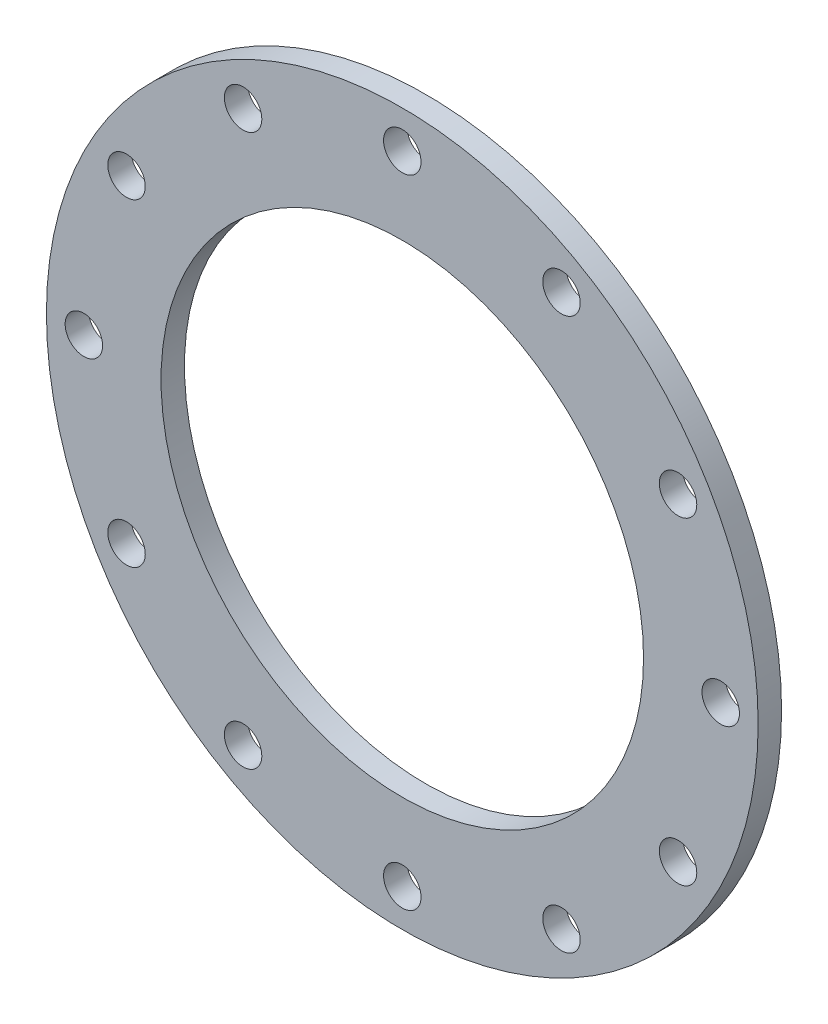
ISO-10303-21;
HEADER;
FILE_DESCRIPTION(('STEP AP214'),'2;1');
FILE_NAME('part.step','',(''),(''),'','','');
FILE_SCHEMA(('AUTOMOTIVE_DESIGN { 1 0 10303 214 1 1 1 1 }'));
ENDSEC;
DATA;
#1=APPLICATION_CONTEXT('core data for automotive mechanical design processes');
#2=APPLICATION_PROTOCOL_DEFINITION('international standard','automotive_design',2000,#1);
#3=PRODUCT_CONTEXT('',#1,'mechanical');
#4=PRODUCT('Part','Part','',(#3));
#5=PRODUCT_RELATED_PRODUCT_CATEGORY('part','',(#4));
#6=PRODUCT_DEFINITION_FORMATION('','',#4);
#7=PRODUCT_DEFINITION_CONTEXT('part definition',#1,'design');
#8=PRODUCT_DEFINITION('design','',#6,#7);
#9=PRODUCT_DEFINITION_SHAPE('','',#8);
#10=(LENGTH_UNIT() NAMED_UNIT(*) SI_UNIT(.MILLI.,.METRE.));
#11=(NAMED_UNIT(*) PLANE_ANGLE_UNIT() SI_UNIT($,.RADIAN.));
#12=(NAMED_UNIT(*) SI_UNIT($,.STERADIAN.) SOLID_ANGLE_UNIT());
#13=UNCERTAINTY_MEASURE_WITH_UNIT(LENGTH_MEASURE(1.E-05),#10,'distance_accuracy_value','');
#14=(GEOMETRIC_REPRESENTATION_CONTEXT(3) GLOBAL_UNCERTAINTY_ASSIGNED_CONTEXT((#13)) GLOBAL_UNIT_ASSIGNED_CONTEXT((#10,
#11,#12)) REPRESENTATION_CONTEXT('',''));
#15=CARTESIAN_POINT('',(0.,0.,0.));
#16=DIRECTION('',(0.,0.,1.));
#17=DIRECTION('',(1.,0.,0.));
#18=AXIS2_PLACEMENT_3D('',#15,#16,#17);
#19=CARTESIAN_POINT('',(0.,0.,7.9375));
#20=DIRECTION('',(0.,0.,1.));
#21=DIRECTION('',(1.,0.,0.));
#22=AXIS2_PLACEMENT_3D('',#19,#20,#21);
#23=PLANE('',#22);
#24=CARTESIAN_POINT('',(107.95,-186.974884677061,7.9375));
#25=DIRECTION('',(0.,0.,1.));
#26=DIRECTION('',(0.499999999999998,-0.86602540378444,0.));
#27=AXIS2_PLACEMENT_3D('',#24,#25,#26);
#28=CIRCLE('',#27,12.7);
#29=CARTESIAN_POINT('',(114.3,-197.973407305123,7.9375));
#30=VERTEX_POINT('',#29);
#31=EDGE_CURVE('E84',#30,#30,#28,.T.);
#32=ORIENTED_EDGE('',*,*,#31,.F.);
#33=EDGE_LOOP('',(#32));
#34=FACE_BOUND('',#33,.T.);
#35=CARTESIAN_POINT('',(-7.39933033248418E-13,-215.9,7.9375));
#36=DIRECTION('',(0.,0.,1.));
#37=DIRECTION('',(0.,-1.,0.));
#38=AXIS2_PLACEMENT_3D('',#35,#36,#37);
#39=CIRCLE('',#38,12.7);
#40=CARTESIAN_POINT('',(-7.84274846251726E-13,-228.6,7.9375));
#41=VERTEX_POINT('',#40);
#42=EDGE_CURVE('E135',#41,#41,#39,.T.);
#43=ORIENTED_EDGE('',*,*,#42,.F.);
#44=EDGE_LOOP('',(#43));
#45=FACE_BOUND('',#44,.T.);
#46=CARTESIAN_POINT('',(-107.950000000001,-186.97488467706,7.9375));
#47=DIRECTION('',(0.,0.,1.));
#48=DIRECTION('',(-0.500000000000004,-0.866025403784436,0.));
#49=AXIS2_PLACEMENT_3D('',#46,#47,#48);
#50=CIRCLE('',#49,12.7);
#51=CARTESIAN_POINT('',(-114.300000000001,-197.973407305122,7.9375));
#52=VERTEX_POINT('',#51);
#53=EDGE_CURVE('E127',#52,#52,#50,.T.);
#54=ORIENTED_EDGE('',*,*,#53,.F.);
#55=EDGE_LOOP('',(#54));
#56=FACE_BOUND('',#55,.T.);
#57=CARTESIAN_POINT('',(-186.974884677061,-107.949999999999,7.9375));
#58=DIRECTION('',(0.,0.,1.));
#59=DIRECTION('',(-0.866025403784442,-0.499999999999995,0.));
#60=AXIS2_PLACEMENT_3D('',#57,#58,#59);
#61=CIRCLE('',#60,12.7);
#62=CARTESIAN_POINT('',(-197.973407305123,-114.299999999999,7.9375));
#63=VERTEX_POINT('',#62);
#64=EDGE_CURVE('E119',#63,#63,#61,.T.);
#65=ORIENTED_EDGE('',*,*,#64,.F.);
#66=EDGE_LOOP('',(#65));
#67=FACE_BOUND('',#66,.T.);
#68=CARTESIAN_POINT('',(-215.9,0.,7.9375));
#69=DIRECTION('',(0.,0.,1.));
#70=DIRECTION('',(-1.,0.,0.));
#71=AXIS2_PLACEMENT_3D('',#68,#69,#70);
#72=CIRCLE('',#71,12.7);
#73=CARTESIAN_POINT('',(-228.6,0.,7.9375));
#74=VERTEX_POINT('',#73);
#75=EDGE_CURVE('E111',#74,#74,#72,.T.);
#76=ORIENTED_EDGE('',*,*,#75,.F.);
#77=EDGE_LOOP('',(#76));
#78=FACE_BOUND('',#77,.T.);
#79=CARTESIAN_POINT('',(-186.974884677059,107.950000000002,7.9375));
#80=DIRECTION('',(0.,0.,1.));
#81=DIRECTION('',(-0.866025403784435,0.500000000000007,0.));
#82=AXIS2_PLACEMENT_3D('',#79,#80,#81);
#83=CIRCLE('',#82,12.7);
#84=CARTESIAN_POINT('',(-197.973407305122,114.300000000002,7.9375));
#85=VERTEX_POINT('',#84);
#86=EDGE_CURVE('E103',#85,#85,#83,.T.);
#87=ORIENTED_EDGE('',*,*,#86,.F.);
#88=EDGE_LOOP('',(#87));
#89=FACE_BOUND('',#88,.T.);
#90=CARTESIAN_POINT('',(-107.949999999998,186.974884677061,7.9375));
#91=DIRECTION('',(0.,0.,1.));
#92=DIRECTION('',(-0.499999999999992,0.866025403784443,0.));
#93=AXIS2_PLACEMENT_3D('',#90,#91,#92);
#94=CIRCLE('',#93,12.7);
#95=CARTESIAN_POINT('',(-114.299999999998,197.973407305124,7.9375));
#96=VERTEX_POINT('',#95);
#97=EDGE_CURVE('E95',#96,#96,#94,.T.);
#98=ORIENTED_EDGE('',*,*,#97,.F.);
#99=EDGE_LOOP('',(#98));
#100=FACE_BOUND('',#99,.T.);
#101=CARTESIAN_POINT('',(2.24755467536088E-12,215.9,7.9375));
#102=DIRECTION('',(0.,0.,1.));
#103=DIRECTION('',(0.,1.,0.));
#104=AXIS2_PLACEMENT_3D('',#101,#102,#103);
#105=CIRCLE('',#104,12.7);
#106=CARTESIAN_POINT('',(2.38058011437081E-12,228.6,7.9375));
#107=VERTEX_POINT('',#106);
#108=EDGE_CURVE('E85',#107,#107,#105,.T.);
#109=ORIENTED_EDGE('',*,*,#108,.F.);
#110=EDGE_LOOP('',(#109));
#111=FACE_BOUND('',#110,.T.);
#112=CARTESIAN_POINT('',(107.950000000002,186.974884677059,7.9375));
#113=DIRECTION('',(0.,0.,1.));
#114=DIRECTION('',(0.50000000000001,0.866025403784433,0.));
#115=AXIS2_PLACEMENT_3D('',#112,#113,#114);
#116=CIRCLE('',#115,12.7);
#117=CARTESIAN_POINT('',(114.300000000002,197.973407305121,7.9375));
#118=VERTEX_POINT('',#117);
#119=EDGE_CURVE('E94',#118,#118,#116,.T.);
#120=ORIENTED_EDGE('',*,*,#119,.F.);
#121=EDGE_LOOP('',(#120));
#122=FACE_BOUND('',#121,.T.);
#123=CARTESIAN_POINT('',(186.974884677062,107.949999999998,7.9375));
#124=DIRECTION('',(0.,0.,1.));
#125=DIRECTION('',(0.866025403784445,0.499999999999989,0.));
#126=AXIS2_PLACEMENT_3D('',#123,#124,#125);
#127=CIRCLE('',#126,12.7);
#128=CARTESIAN_POINT('',(197.973407305124,114.299999999997,7.9375));
#129=VERTEX_POINT('',#128);
#130=EDGE_CURVE('E149',#129,#129,#127,.T.);
#131=ORIENTED_EDGE('',*,*,#130,.F.);
#132=EDGE_LOOP('',(#131));
#133=FACE_BOUND('',#132,.T.);
#134=CARTESIAN_POINT('',(186.97488467706,-107.95,7.9375));
#135=DIRECTION('',(0.,0.,1.));
#136=DIRECTION('',(0.866025403784438,-0.500000000000001,0.));
#137=AXIS2_PLACEMENT_3D('',#134,#135,#136);
#138=CIRCLE('',#137,12.7);
#139=CARTESIAN_POINT('',(197.973407305122,-114.3,7.9375));
#140=VERTEX_POINT('',#139);
#141=EDGE_CURVE('E76',#140,#140,#138,.T.);
#142=ORIENTED_EDGE('',*,*,#141,.F.);
#143=EDGE_LOOP('',(#142));
#144=FACE_BOUND('',#143,.T.);
#145=CARTESIAN_POINT('',(215.9,0.,7.9375));
#146=DIRECTION('',(0.,0.,1.));
#147=DIRECTION('',(1.,0.,0.));
#148=AXIS2_PLACEMENT_3D('',#145,#146,#147);
#149=CIRCLE('',#148,12.7);
#150=CARTESIAN_POINT('',(228.6,0.,7.9375));
#151=VERTEX_POINT('',#150);
#152=EDGE_CURVE('E72',#151,#151,#149,.T.);
#153=ORIENTED_EDGE('',*,*,#152,.F.);
#154=EDGE_LOOP('',(#153));
#155=FACE_BOUND('',#154,.T.);
#156=CARTESIAN_POINT('',(0.,0.,7.9375));
#157=DIRECTION('',(0.,0.,1.));
#158=DIRECTION('',(1.,0.,0.));
#159=AXIS2_PLACEMENT_3D('',#156,#157,#158);
#160=CIRCLE('',#159,241.3);
#161=CARTESIAN_POINT('',(241.3,0.,7.9375));
#162=VERTEX_POINT('',#161);
#163=EDGE_CURVE('E11',#162,#162,#160,.T.);
#164=ORIENTED_EDGE('',*,*,#163,.T.);
#165=EDGE_LOOP('',(#164));
#166=FACE_BOUND('',#165,.T.);
#167=CARTESIAN_POINT('',(0.,0.,7.9375));
#168=DIRECTION('',(0.,0.,1.));
#169=DIRECTION('',(1.,0.,0.));
#170=AXIS2_PLACEMENT_3D('',#167,#168,#169);
#171=CIRCLE('',#170,163.576);
#172=CARTESIAN_POINT('',(163.576,0.,7.9375));
#173=VERTEX_POINT('',#172);
#174=EDGE_CURVE('E59',#173,#173,#171,.T.);
#175=ORIENTED_EDGE('',*,*,#174,.F.);
#176=EDGE_LOOP('',(#175));
#177=FACE_BOUND('',#176,.T.);
#178=ADVANCED_FACE('F46',(#34,#45,#56,#67,#78,#89,#100,#111,#122,#133,#144,#155,#166,#177),#23,.T.);
#179=CARTESIAN_POINT('',(0.,0.,-7.9375));
#180=DIRECTION('',(0.,0.,1.));
#181=DIRECTION('',(1.,0.,0.));
#182=AXIS2_PLACEMENT_3D('',#179,#180,#181);
#183=PLANE('',#182);
#184=CARTESIAN_POINT('',(107.95,-186.974884677061,-7.9375));
#185=DIRECTION('',(0.,0.,1.));
#186=DIRECTION('',(0.499999999999998,-0.86602540378444,0.));
#187=AXIS2_PLACEMENT_3D('',#184,#185,#186);
#188=CIRCLE('',#187,12.7);
#189=CARTESIAN_POINT('',(114.3,-197.973407305123,-7.9375));
#190=VERTEX_POINT('',#189);
#191=EDGE_CURVE('E139',#190,#190,#188,.T.);
#192=ORIENTED_EDGE('',*,*,#191,.T.);
#193=EDGE_LOOP('',(#192));
#194=FACE_BOUND('',#193,.T.);
#195=CARTESIAN_POINT('',(-7.39933033248418E-13,-215.9,-7.9375));
#196=DIRECTION('',(0.,0.,1.));
#197=DIRECTION('',(0.,-1.,0.));
#198=AXIS2_PLACEMENT_3D('',#195,#196,#197);
#199=CIRCLE('',#198,12.7);
#200=CARTESIAN_POINT('',(-7.84274846251726E-13,-228.6,-7.9375));
#201=VERTEX_POINT('',#200);
#202=EDGE_CURVE('E131',#201,#201,#199,.T.);
#203=ORIENTED_EDGE('',*,*,#202,.T.);
#204=EDGE_LOOP('',(#203));
#205=FACE_BOUND('',#204,.T.);
#206=CARTESIAN_POINT('',(-107.950000000001,-186.97488467706,-7.9375));
#207=DIRECTION('',(0.,0.,1.));
#208=DIRECTION('',(-0.500000000000004,-0.866025403784436,0.));
#209=AXIS2_PLACEMENT_3D('',#206,#207,#208);
#210=CIRCLE('',#209,12.7);
#211=CARTESIAN_POINT('',(-114.300000000001,-197.973407305122,-7.9375));
#212=VERTEX_POINT('',#211);
#213=EDGE_CURVE('E123',#212,#212,#210,.T.);
#214=ORIENTED_EDGE('',*,*,#213,.T.);
#215=EDGE_LOOP('',(#214));
#216=FACE_BOUND('',#215,.T.);
#217=CARTESIAN_POINT('',(-186.974884677061,-107.949999999999,-7.9375));
#218=DIRECTION('',(0.,0.,1.));
#219=DIRECTION('',(-0.866025403784442,-0.499999999999995,0.));
#220=AXIS2_PLACEMENT_3D('',#217,#218,#219);
#221=CIRCLE('',#220,12.7);
#222=CARTESIAN_POINT('',(-197.973407305123,-114.299999999999,-7.9375));
#223=VERTEX_POINT('',#222);
#224=EDGE_CURVE('E115',#223,#223,#221,.T.);
#225=ORIENTED_EDGE('',*,*,#224,.T.);
#226=EDGE_LOOP('',(#225));
#227=FACE_BOUND('',#226,.T.);
#228=CARTESIAN_POINT('',(-215.9,0.,-7.9375));
#229=DIRECTION('',(0.,0.,1.));
#230=DIRECTION('',(-1.,0.,0.));
#231=AXIS2_PLACEMENT_3D('',#228,#229,#230);
#232=CIRCLE('',#231,12.7);
#233=CARTESIAN_POINT('',(-228.6,0.,-7.9375));
#234=VERTEX_POINT('',#233);
#235=EDGE_CURVE('E107',#234,#234,#232,.T.);
#236=ORIENTED_EDGE('',*,*,#235,.T.);
#237=EDGE_LOOP('',(#236));
#238=FACE_BOUND('',#237,.T.);
#239=CARTESIAN_POINT('',(-186.974884677059,107.950000000002,-7.9375));
#240=DIRECTION('',(0.,0.,1.));
#241=DIRECTION('',(-0.866025403784435,0.500000000000007,0.));
#242=AXIS2_PLACEMENT_3D('',#239,#240,#241);
#243=CIRCLE('',#242,12.7);
#244=CARTESIAN_POINT('',(-197.973407305122,114.300000000002,-7.9375));
#245=VERTEX_POINT('',#244);
#246=EDGE_CURVE('E99',#245,#245,#243,.T.);
#247=ORIENTED_EDGE('',*,*,#246,.T.);
#248=EDGE_LOOP('',(#247));
#249=FACE_BOUND('',#248,.T.);
#250=CARTESIAN_POINT('',(-107.949999999998,186.974884677061,-7.9375));
#251=DIRECTION('',(0.,0.,1.));
#252=DIRECTION('',(-0.499999999999992,0.866025403784443,0.));
#253=AXIS2_PLACEMENT_3D('',#250,#251,#252);
#254=CIRCLE('',#253,12.7);
#255=CARTESIAN_POINT('',(-114.299999999998,197.973407305124,-7.9375));
#256=VERTEX_POINT('',#255);
#257=EDGE_CURVE('E89',#256,#256,#254,.T.);
#258=ORIENTED_EDGE('',*,*,#257,.T.);
#259=EDGE_LOOP('',(#258));
#260=FACE_BOUND('',#259,.T.);
#261=CARTESIAN_POINT('',(2.24755467536088E-12,215.9,-7.9375));
#262=DIRECTION('',(0.,0.,1.));
#263=DIRECTION('',(0.,1.,0.));
#264=AXIS2_PLACEMENT_3D('',#261,#262,#263);
#265=CIRCLE('',#264,12.7);
#266=CARTESIAN_POINT('',(2.38058011437081E-12,228.6,-7.9375));
#267=VERTEX_POINT('',#266);
#268=EDGE_CURVE('E90',#267,#267,#265,.T.);
#269=ORIENTED_EDGE('',*,*,#268,.T.);
#270=EDGE_LOOP('',(#269));
#271=FACE_BOUND('',#270,.T.);
#272=CARTESIAN_POINT('',(107.950000000002,186.974884677059,-7.9375));
#273=DIRECTION('',(0.,0.,1.));
#274=DIRECTION('',(0.50000000000001,0.866025403784433,0.));
#275=AXIS2_PLACEMENT_3D('',#272,#273,#274);
#276=CIRCLE('',#275,12.7);
#277=CARTESIAN_POINT('',(114.300000000002,197.973407305121,-7.9375));
#278=VERTEX_POINT('',#277);
#279=EDGE_CURVE('E153',#278,#278,#276,.T.);
#280=ORIENTED_EDGE('',*,*,#279,.T.);
#281=EDGE_LOOP('',(#280));
#282=FACE_BOUND('',#281,.T.);
#283=CARTESIAN_POINT('',(186.974884677062,107.949999999998,-7.9375));
#284=DIRECTION('',(0.,0.,1.));
#285=DIRECTION('',(0.866025403784445,0.499999999999989,0.));
#286=AXIS2_PLACEMENT_3D('',#283,#284,#285);
#287=CIRCLE('',#286,12.7);
#288=CARTESIAN_POINT('',(197.973407305124,114.299999999997,-7.9375));
#289=VERTEX_POINT('',#288);
#290=EDGE_CURVE('E154',#289,#289,#287,.T.);
#291=ORIENTED_EDGE('',*,*,#290,.T.);
#292=EDGE_LOOP('',(#291));
#293=FACE_BOUND('',#292,.T.);
#294=CARTESIAN_POINT('',(186.97488467706,-107.95,-7.9375));
#295=DIRECTION('',(0.,0.,1.));
#296=DIRECTION('',(0.866025403784438,-0.500000000000001,0.));
#297=AXIS2_PLACEMENT_3D('',#294,#295,#296);
#298=CIRCLE('',#297,12.7);
#299=CARTESIAN_POINT('',(197.973407305122,-114.3,-7.9375));
#300=VERTEX_POINT('',#299);
#301=EDGE_CURVE('E80',#300,#300,#298,.T.);
#302=ORIENTED_EDGE('',*,*,#301,.T.);
#303=EDGE_LOOP('',(#302));
#304=FACE_BOUND('',#303,.T.);
#305=CARTESIAN_POINT('',(215.9,0.,-7.9375));
#306=DIRECTION('',(0.,0.,1.));
#307=DIRECTION('',(1.,0.,0.));
#308=AXIS2_PLACEMENT_3D('',#305,#306,#307);
#309=CIRCLE('',#308,12.7);
#310=CARTESIAN_POINT('',(228.6,0.,-7.9375));
#311=VERTEX_POINT('',#310);
#312=EDGE_CURVE('E65',#311,#311,#309,.T.);
#313=ORIENTED_EDGE('',*,*,#312,.T.);
#314=EDGE_LOOP('',(#313));
#315=FACE_BOUND('',#314,.T.);
#316=CARTESIAN_POINT('',(0.,0.,-7.9375));
#317=DIRECTION('',(0.,0.,1.));
#318=DIRECTION('',(1.,0.,0.));
#319=AXIS2_PLACEMENT_3D('',#316,#317,#318);
#320=CIRCLE('',#319,241.3);
#321=CARTESIAN_POINT('',(241.3,0.,-7.9375));
#322=VERTEX_POINT('',#321);
#323=EDGE_CURVE('E50',#322,#322,#320,.T.);
#324=ORIENTED_EDGE('',*,*,#323,.F.);
#325=EDGE_LOOP('',(#324));
#326=FACE_BOUND('',#325,.T.);
#327=CARTESIAN_POINT('',(0.,0.,-7.9375));
#328=DIRECTION('',(0.,0.,1.));
#329=DIRECTION('',(1.,0.,0.));
#330=AXIS2_PLACEMENT_3D('',#327,#328,#329);
#331=CIRCLE('',#330,163.576);
#332=CARTESIAN_POINT('',(163.576,0.,-7.9375));
#333=VERTEX_POINT('',#332);
#334=EDGE_CURVE('E61',#333,#333,#331,.T.);
#335=ORIENTED_EDGE('',*,*,#334,.T.);
#336=EDGE_LOOP('',(#335));
#337=FACE_BOUND('',#336,.T.);
#338=ADVANCED_FACE('F165',(#194,#205,#216,#227,#238,#249,#260,#271,#282,#293,#304,#315,#326,
#337),#183,.F.);
#339=CARTESIAN_POINT('',(0.,0.,7.9375));
#340=DIRECTION('',(0.,0.,-1.));
#341=DIRECTION('',(-1.,0.,0.));
#342=AXIS2_PLACEMENT_3D('',#339,#340,#341);
#343=CYLINDRICAL_SURFACE('',#342,241.3);
#344=ORIENTED_EDGE('',*,*,#163,.F.);
#345=EDGE_LOOP('',(#344));
#346=FACE_BOUND('',#345,.T.);
#347=ORIENTED_EDGE('',*,*,#323,.T.);
#348=EDGE_LOOP('',(#347));
#349=FACE_BOUND('',#348,.T.);
#350=ADVANCED_FACE('F48',(#346,#349),#343,.T.);
#351=CARTESIAN_POINT('',(0.,0.,7.9375));
#352=DIRECTION('',(0.,0.,-1.));
#353=DIRECTION('',(-1.,0.,0.));
#354=AXIS2_PLACEMENT_3D('',#351,#352,#353);
#355=CYLINDRICAL_SURFACE('',#354,163.576);
#356=ORIENTED_EDGE('',*,*,#174,.T.);
#357=EDGE_LOOP('',(#356));
#358=FACE_BOUND('',#357,.T.);
#359=ORIENTED_EDGE('',*,*,#334,.F.);
#360=EDGE_LOOP('',(#359));
#361=FACE_BOUND('',#360,.T.);
#362=ADVANCED_FACE('F188',(#358,#361),#355,.F.);
#363=CARTESIAN_POINT('',(215.9,0.,7.9375));
#364=DIRECTION('',(0.,0.,1.));
#365=DIRECTION('',(1.,0.,0.));
#366=AXIS2_PLACEMENT_3D('',#363,#364,#365);
#367=CYLINDRICAL_SURFACE('',#366,12.7);
#368=ORIENTED_EDGE('',*,*,#312,.F.);
#369=EDGE_LOOP('',(#368));
#370=FACE_BOUND('',#369,.T.);
#371=ORIENTED_EDGE('',*,*,#152,.T.);
#372=EDGE_LOOP('',(#371));
#373=FACE_BOUND('',#372,.T.);
#374=ADVANCED_FACE('F191',(#370,#373),#367,.F.);
#375=CARTESIAN_POINT('',(186.97488467706,-107.95,7.9375));
#376=DIRECTION('',(0.,0.,1.));
#377=DIRECTION('',(0.866025403784438,-0.500000000000001,0.));
#378=AXIS2_PLACEMENT_3D('',#375,#376,#377);
#379=CYLINDRICAL_SURFACE('',#378,12.7);
#380=ORIENTED_EDGE('',*,*,#301,.F.);
#381=EDGE_LOOP('',(#380));
#382=FACE_BOUND('',#381,.T.);
#383=ORIENTED_EDGE('',*,*,#141,.T.);
#384=EDGE_LOOP('',(#383));
#385=FACE_BOUND('',#384,.T.);
#386=ADVANCED_FACE('F205',(#382,#385),#379,.F.);
#387=CARTESIAN_POINT('',(186.974884677062,107.949999999998,7.9375));
#388=DIRECTION('',(0.,0.,1.));
#389=DIRECTION('',(0.866025403784445,0.499999999999989,0.));
#390=AXIS2_PLACEMENT_3D('',#387,#388,#389);
#391=CYLINDRICAL_SURFACE('',#390,12.7);
#392=ORIENTED_EDGE('',*,*,#290,.F.);
#393=EDGE_LOOP('',(#392));
#394=FACE_BOUND('',#393,.T.);
#395=ORIENTED_EDGE('',*,*,#130,.T.);
#396=EDGE_LOOP('',(#395));
#397=FACE_BOUND('',#396,.T.);
#398=ADVANCED_FACE('F172',(#394,#397),#391,.F.);
#399=CARTESIAN_POINT('',(107.950000000002,186.974884677059,7.9375));
#400=DIRECTION('',(0.,0.,1.));
#401=DIRECTION('',(0.50000000000001,0.866025403784433,0.));
#402=AXIS2_PLACEMENT_3D('',#399,#400,#401);
#403=CYLINDRICAL_SURFACE('',#402,12.7);
#404=ORIENTED_EDGE('',*,*,#279,.F.);
#405=EDGE_LOOP('',(#404));
#406=FACE_BOUND('',#405,.T.);
#407=ORIENTED_EDGE('',*,*,#119,.T.);
#408=EDGE_LOOP('',(#407));
#409=FACE_BOUND('',#408,.T.);
#410=ADVANCED_FACE('F168',(#406,#409),#403,.F.);
#411=CARTESIAN_POINT('',(2.24755467536088E-12,215.9,7.9375));
#412=DIRECTION('',(0.,0.,1.));
#413=DIRECTION('',(0.,1.,0.));
#414=AXIS2_PLACEMENT_3D('',#411,#412,#413);
#415=CYLINDRICAL_SURFACE('',#414,12.7);
#416=ORIENTED_EDGE('',*,*,#268,.F.);
#417=EDGE_LOOP('',(#416));
#418=FACE_BOUND('',#417,.T.);
#419=ORIENTED_EDGE('',*,*,#108,.T.);
#420=EDGE_LOOP('',(#419));
#421=FACE_BOUND('',#420,.T.);
#422=ADVANCED_FACE('F171',(#418,#421),#415,.F.);
#423=CARTESIAN_POINT('',(-107.949999999998,186.974884677061,7.9375));
#424=DIRECTION('',(0.,0.,1.));
#425=DIRECTION('',(-0.499999999999992,0.866025403784443,0.));
#426=AXIS2_PLACEMENT_3D('',#423,#424,#425);
#427=CYLINDRICAL_SURFACE('',#426,12.7);
#428=ORIENTED_EDGE('',*,*,#257,.F.);
#429=EDGE_LOOP('',(#428));
#430=FACE_BOUND('',#429,.T.);
#431=ORIENTED_EDGE('',*,*,#97,.T.);
#432=EDGE_LOOP('',(#431));
#433=FACE_BOUND('',#432,.T.);
#434=ADVANCED_FACE('F212',(#430,#433),#427,.F.);
#435=CARTESIAN_POINT('',(-186.974884677059,107.950000000002,7.9375));
#436=DIRECTION('',(0.,0.,1.));
#437=DIRECTION('',(-0.866025403784435,0.500000000000007,0.));
#438=AXIS2_PLACEMENT_3D('',#435,#436,#437);
#439=CYLINDRICAL_SURFACE('',#438,12.7);
#440=ORIENTED_EDGE('',*,*,#246,.F.);
#441=EDGE_LOOP('',(#440));
#442=FACE_BOUND('',#441,.T.);
#443=ORIENTED_EDGE('',*,*,#86,.T.);
#444=EDGE_LOOP('',(#443));
#445=FACE_BOUND('',#444,.T.);
#446=ADVANCED_FACE('F216',(#442,#445),#439,.F.);
#447=CARTESIAN_POINT('',(-215.9,0.,7.9375));
#448=DIRECTION('',(0.,0.,1.));
#449=DIRECTION('',(-1.,0.,0.));
#450=AXIS2_PLACEMENT_3D('',#447,#448,#449);
#451=CYLINDRICAL_SURFACE('',#450,12.7);
#452=ORIENTED_EDGE('',*,*,#235,.F.);
#453=EDGE_LOOP('',(#452));
#454=FACE_BOUND('',#453,.T.);
#455=ORIENTED_EDGE('',*,*,#75,.T.);
#456=EDGE_LOOP('',(#455));
#457=FACE_BOUND('',#456,.T.);
#458=ADVANCED_FACE('F220',(#454,#457),#451,.F.);
#459=CARTESIAN_POINT('',(-186.974884677061,-107.949999999999,7.9375));
#460=DIRECTION('',(0.,0.,1.));
#461=DIRECTION('',(-0.866025403784442,-0.499999999999995,0.));
#462=AXIS2_PLACEMENT_3D('',#459,#460,#461);
#463=CYLINDRICAL_SURFACE('',#462,12.7);
#464=ORIENTED_EDGE('',*,*,#224,.F.);
#465=EDGE_LOOP('',(#464));
#466=FACE_BOUND('',#465,.T.);
#467=ORIENTED_EDGE('',*,*,#64,.T.);
#468=EDGE_LOOP('',(#467));
#469=FACE_BOUND('',#468,.T.);
#470=ADVANCED_FACE('F224',(#466,#469),#463,.F.);
#471=CARTESIAN_POINT('',(-107.950000000001,-186.97488467706,7.9375));
#472=DIRECTION('',(0.,0.,1.));
#473=DIRECTION('',(-0.500000000000004,-0.866025403784436,0.));
#474=AXIS2_PLACEMENT_3D('',#471,#472,#473);
#475=CYLINDRICAL_SURFACE('',#474,12.7);
#476=ORIENTED_EDGE('',*,*,#213,.F.);
#477=EDGE_LOOP('',(#476));
#478=FACE_BOUND('',#477,.T.);
#479=ORIENTED_EDGE('',*,*,#53,.T.);
#480=EDGE_LOOP('',(#479));
#481=FACE_BOUND('',#480,.T.);
#482=ADVANCED_FACE('F228',(#478,#481),#475,.F.);
#483=CARTESIAN_POINT('',(-7.39933033248418E-13,-215.9,7.9375));
#484=DIRECTION('',(0.,0.,1.));
#485=DIRECTION('',(0.,-1.,0.));
#486=AXIS2_PLACEMENT_3D('',#483,#484,#485);
#487=CYLINDRICAL_SURFACE('',#486,12.7);
#488=ORIENTED_EDGE('',*,*,#202,.F.);
#489=EDGE_LOOP('',(#488));
#490=FACE_BOUND('',#489,.T.);
#491=ORIENTED_EDGE('',*,*,#42,.T.);
#492=EDGE_LOOP('',(#491));
#493=FACE_BOUND('',#492,.T.);
#494=ADVANCED_FACE('F232',(#490,#493),#487,.F.);
#495=CARTESIAN_POINT('',(107.95,-186.974884677061,7.9375));
#496=DIRECTION('',(0.,0.,1.));
#497=DIRECTION('',(0.499999999999998,-0.86602540378444,0.));
#498=AXIS2_PLACEMENT_3D('',#495,#496,#497);
#499=CYLINDRICAL_SURFACE('',#498,12.7);
#500=ORIENTED_EDGE('',*,*,#191,.F.);
#501=EDGE_LOOP('',(#500));
#502=FACE_BOUND('',#501,.T.);
#503=ORIENTED_EDGE('',*,*,#31,.T.);
#504=EDGE_LOOP('',(#503));
#505=FACE_BOUND('',#504,.T.);
#506=ADVANCED_FACE('F236',(#502,#505),#499,.F.);
#507=CLOSED_SHELL('',(#178,#338,#350,#362,#374,#386,#398,#410,#422,#434,#446,#458,#470,#482,
#494,#506));
#508=MANIFOLD_SOLID_BREP('B2',#507);
#509=ADVANCED_BREP_SHAPE_REPRESENTATION('',(#18,#508),#14);
#510=SHAPE_DEFINITION_REPRESENTATION(#9,#509);
ENDSEC;
END-ISO-10303-21;
